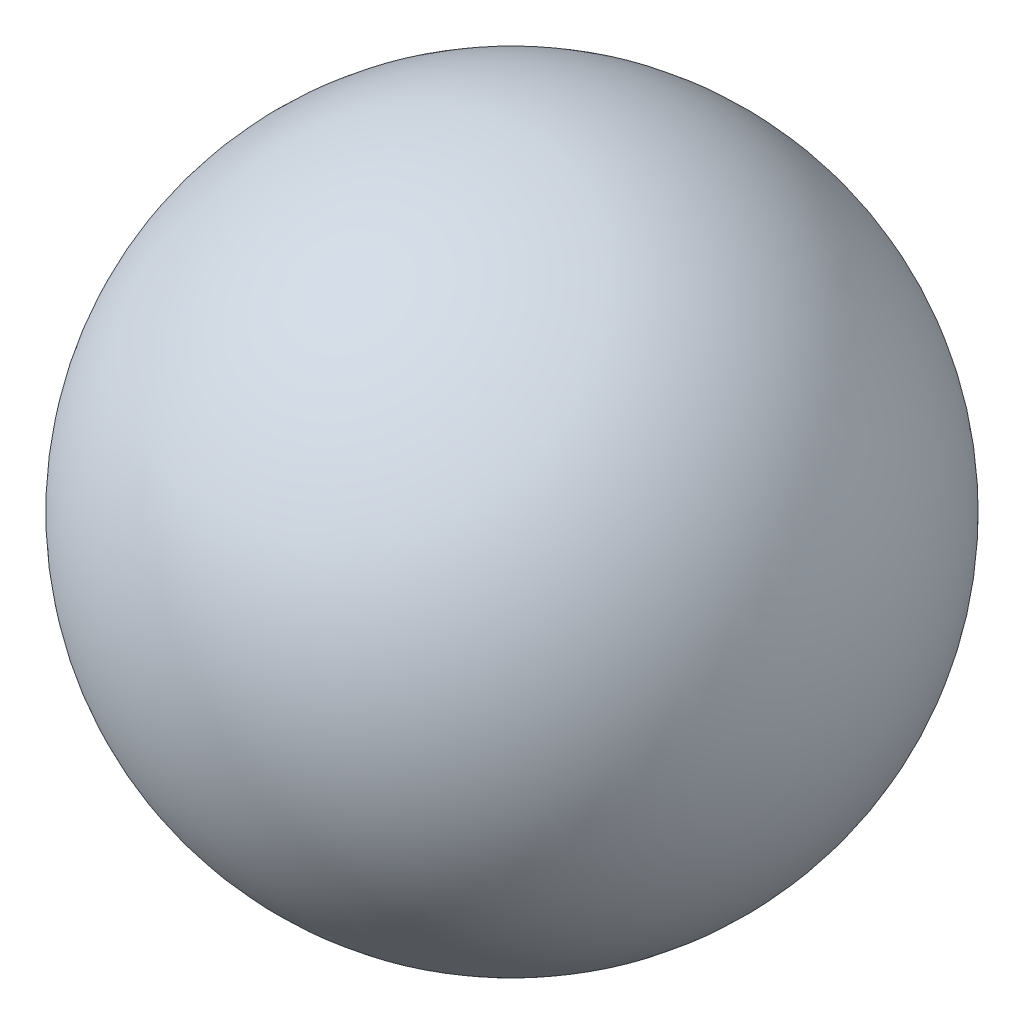
ISO-10303-21;
HEADER;
FILE_DESCRIPTION(('STEP AP214'),'2;1');
FILE_NAME('part.step','',(''),(''),'','','');
FILE_SCHEMA(('AUTOMOTIVE_DESIGN { 1 0 10303 214 1 1 1 1 }'));
ENDSEC;
DATA;
#1=APPLICATION_CONTEXT('core data for automotive mechanical design processes');
#2=APPLICATION_PROTOCOL_DEFINITION('international standard','automotive_design',2000,#1);
#3=PRODUCT_CONTEXT('',#1,'mechanical');
#4=PRODUCT('Part','Part','',(#3));
#5=PRODUCT_RELATED_PRODUCT_CATEGORY('part','',(#4));
#6=PRODUCT_DEFINITION_FORMATION('','',#4);
#7=PRODUCT_DEFINITION_CONTEXT('part definition',#1,'design');
#8=PRODUCT_DEFINITION('design','',#6,#7);
#9=PRODUCT_DEFINITION_SHAPE('','',#8);
#10=(LENGTH_UNIT() NAMED_UNIT(*) SI_UNIT(.MILLI.,.METRE.));
#11=(NAMED_UNIT(*) PLANE_ANGLE_UNIT() SI_UNIT($,.RADIAN.));
#12=(NAMED_UNIT(*) SI_UNIT($,.STERADIAN.) SOLID_ANGLE_UNIT());
#13=UNCERTAINTY_MEASURE_WITH_UNIT(LENGTH_MEASURE(1.E-05),#10,'distance_accuracy_value','');
#14=(GEOMETRIC_REPRESENTATION_CONTEXT(3) GLOBAL_UNCERTAINTY_ASSIGNED_CONTEXT((#13)) GLOBAL_UNIT_ASSIGNED_CONTEXT((#10,
#11,#12)) REPRESENTATION_CONTEXT('',''));
#15=CARTESIAN_POINT('',(0.,0.,0.));
#16=DIRECTION('',(0.,0.,1.));
#17=DIRECTION('',(1.,0.,0.));
#18=AXIS2_PLACEMENT_3D('',#15,#16,#17);
#19=CARTESIAN_POINT('',(0.,0.,0.));
#20=DIRECTION('',(0.,-1.,0.));
#21=DIRECTION('',(-1.,0.,0.));
#22=AXIS2_PLACEMENT_3D('',#19,#20,#21);
#23=SPHERICAL_SURFACE('',#22,3.25);
#24=CARTESIAN_POINT('',(0.,-3.25,0.));
#25=VERTEX_POINT('',#24);
#26=VERTEX_LOOP('',#25);
#27=FACE_BOUND('',#26,.T.);
#28=ADVANCED_FACE('F30',(#27),#23,.T.);
#29=CLOSED_SHELL('',(#28));
#30=MANIFOLD_SOLID_BREP('B2',#29);
#31=ADVANCED_BREP_SHAPE_REPRESENTATION('',(#18,#30),#14);
#32=SHAPE_DEFINITION_REPRESENTATION(#9,#31);
ENDSEC;
END-ISO-10303-21;
